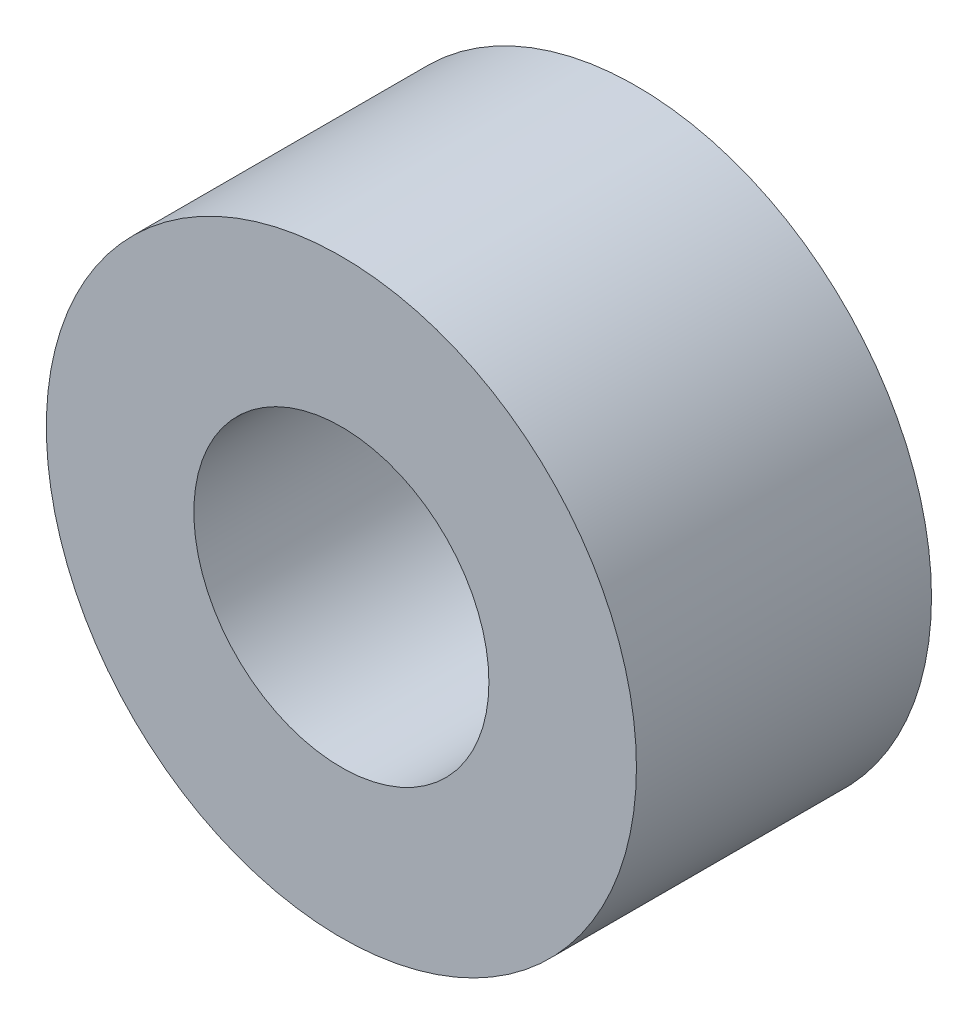
ISO-10303-21;
HEADER;
FILE_DESCRIPTION(('STEP AP214'),'2;1');
FILE_NAME('part.step','',(''),(''),'','','');
FILE_SCHEMA(('AUTOMOTIVE_DESIGN { 1 0 10303 214 1 1 1 1 }'));
ENDSEC;
DATA;
#1=APPLICATION_CONTEXT('core data for automotive mechanical design processes');
#2=APPLICATION_PROTOCOL_DEFINITION('international standard','automotive_design',2000,#1);
#3=PRODUCT_CONTEXT('',#1,'mechanical');
#4=PRODUCT('Part','Part','',(#3));
#5=PRODUCT_RELATED_PRODUCT_CATEGORY('part','',(#4));
#6=PRODUCT_DEFINITION_FORMATION('','',#4);
#7=PRODUCT_DEFINITION_CONTEXT('part definition',#1,'design');
#8=PRODUCT_DEFINITION('design','',#6,#7);
#9=PRODUCT_DEFINITION_SHAPE('','',#8);
#10=(LENGTH_UNIT() NAMED_UNIT(*) SI_UNIT(.MILLI.,.METRE.));
#11=(NAMED_UNIT(*) PLANE_ANGLE_UNIT() SI_UNIT($,.RADIAN.));
#12=(NAMED_UNIT(*) SI_UNIT($,.STERADIAN.) SOLID_ANGLE_UNIT());
#13=UNCERTAINTY_MEASURE_WITH_UNIT(LENGTH_MEASURE(1.E-05),#10,'distance_accuracy_value','');
#14=(GEOMETRIC_REPRESENTATION_CONTEXT(3) GLOBAL_UNCERTAINTY_ASSIGNED_CONTEXT((#13)) GLOBAL_UNIT_ASSIGNED_CONTEXT((#10,
#11,#12)) REPRESENTATION_CONTEXT('',''));
#15=CARTESIAN_POINT('',(0.,0.,0.));
#16=DIRECTION('',(0.,0.,1.));
#17=DIRECTION('',(1.,0.,0.));
#18=AXIS2_PLACEMENT_3D('',#15,#16,#17);
#19=CARTESIAN_POINT('',(0.,0.,3.));
#20=DIRECTION('',(0.,0.,1.));
#21=DIRECTION('',(1.,0.,0.));
#22=AXIS2_PLACEMENT_3D('',#19,#20,#21);
#23=PLANE('',#22);
#24=CARTESIAN_POINT('',(0.,0.,3.));
#25=DIRECTION('',(0.,0.,1.));
#26=DIRECTION('',(1.,0.,0.));
#27=AXIS2_PLACEMENT_3D('',#24,#25,#26);
#28=CIRCLE('',#27,3.);
#29=CARTESIAN_POINT('',(3.,0.,3.));
#30=VERTEX_POINT('',#29);
#31=EDGE_CURVE('E10',#30,#30,#28,.T.);
#32=ORIENTED_EDGE('',*,*,#31,.T.);
#33=EDGE_LOOP('',(#32));
#34=FACE_BOUND('',#33,.T.);
#35=CARTESIAN_POINT('',(0.,0.,3.));
#36=DIRECTION('',(0.,0.,1.));
#37=DIRECTION('',(1.,0.,0.));
#38=AXIS2_PLACEMENT_3D('',#35,#36,#37);
#39=CIRCLE('',#38,1.5);
#40=CARTESIAN_POINT('',(1.5,0.,3.));
#41=VERTEX_POINT('',#40);
#42=EDGE_CURVE('E43',#41,#41,#39,.T.);
#43=ORIENTED_EDGE('',*,*,#42,.F.);
#44=EDGE_LOOP('',(#43));
#45=FACE_BOUND('',#44,.T.);
#46=ADVANCED_FACE('F32',(#34,#45),#23,.T.);
#47=CARTESIAN_POINT('',(0.,0.,0.));
#48=DIRECTION('',(0.,0.,1.));
#49=DIRECTION('',(1.,0.,0.));
#50=AXIS2_PLACEMENT_3D('',#47,#48,#49);
#51=PLANE('',#50);
#52=CARTESIAN_POINT('',(0.,0.,0.));
#53=DIRECTION('',(0.,0.,1.));
#54=DIRECTION('',(1.,0.,0.));
#55=AXIS2_PLACEMENT_3D('',#52,#53,#54);
#56=CIRCLE('',#55,3.);
#57=CARTESIAN_POINT('',(3.,0.,0.));
#58=VERTEX_POINT('',#57);
#59=EDGE_CURVE('E36',#58,#58,#56,.T.);
#60=ORIENTED_EDGE('',*,*,#59,.F.);
#61=EDGE_LOOP('',(#60));
#62=FACE_BOUND('',#61,.T.);
#63=CARTESIAN_POINT('',(0.,0.,0.));
#64=DIRECTION('',(0.,0.,1.));
#65=DIRECTION('',(1.,0.,0.));
#66=AXIS2_PLACEMENT_3D('',#63,#64,#65);
#67=CIRCLE('',#66,1.5);
#68=CARTESIAN_POINT('',(1.5,0.,0.));
#69=VERTEX_POINT('',#68);
#70=EDGE_CURVE('E45',#69,#69,#67,.T.);
#71=ORIENTED_EDGE('',*,*,#70,.T.);
#72=EDGE_LOOP('',(#71));
#73=FACE_BOUND('',#72,.T.);
#74=ADVANCED_FACE('F55',(#62,#73),#51,.F.);
#75=CARTESIAN_POINT('',(0.,0.,3.));
#76=DIRECTION('',(0.,0.,-1.));
#77=DIRECTION('',(-1.,0.,0.));
#78=AXIS2_PLACEMENT_3D('',#75,#76,#77);
#79=CYLINDRICAL_SURFACE('',#78,3.);
#80=ORIENTED_EDGE('',*,*,#31,.F.);
#81=EDGE_LOOP('',(#80));
#82=FACE_BOUND('',#81,.T.);
#83=ORIENTED_EDGE('',*,*,#59,.T.);
#84=EDGE_LOOP('',(#83));
#85=FACE_BOUND('',#84,.T.);
#86=ADVANCED_FACE('F34',(#82,#85),#79,.T.);
#87=CARTESIAN_POINT('',(0.,0.,3.));
#88=DIRECTION('',(0.,0.,-1.));
#89=DIRECTION('',(-1.,0.,0.));
#90=AXIS2_PLACEMENT_3D('',#87,#88,#89);
#91=CYLINDRICAL_SURFACE('',#90,1.5);
#92=ORIENTED_EDGE('',*,*,#42,.T.);
#93=EDGE_LOOP('',(#92));
#94=FACE_BOUND('',#93,.T.);
#95=ORIENTED_EDGE('',*,*,#70,.F.);
#96=EDGE_LOOP('',(#95));
#97=FACE_BOUND('',#96,.T.);
#98=ADVANCED_FACE('F51',(#94,#97),#91,.F.);
#99=CLOSED_SHELL('',(#46,#74,#86,#98));
#100=MANIFOLD_SOLID_BREP('B2',#99);
#101=ADVANCED_BREP_SHAPE_REPRESENTATION('',(#18,#100),#14);
#102=SHAPE_DEFINITION_REPRESENTATION(#9,#101);
ENDSEC;
END-ISO-10303-21;
